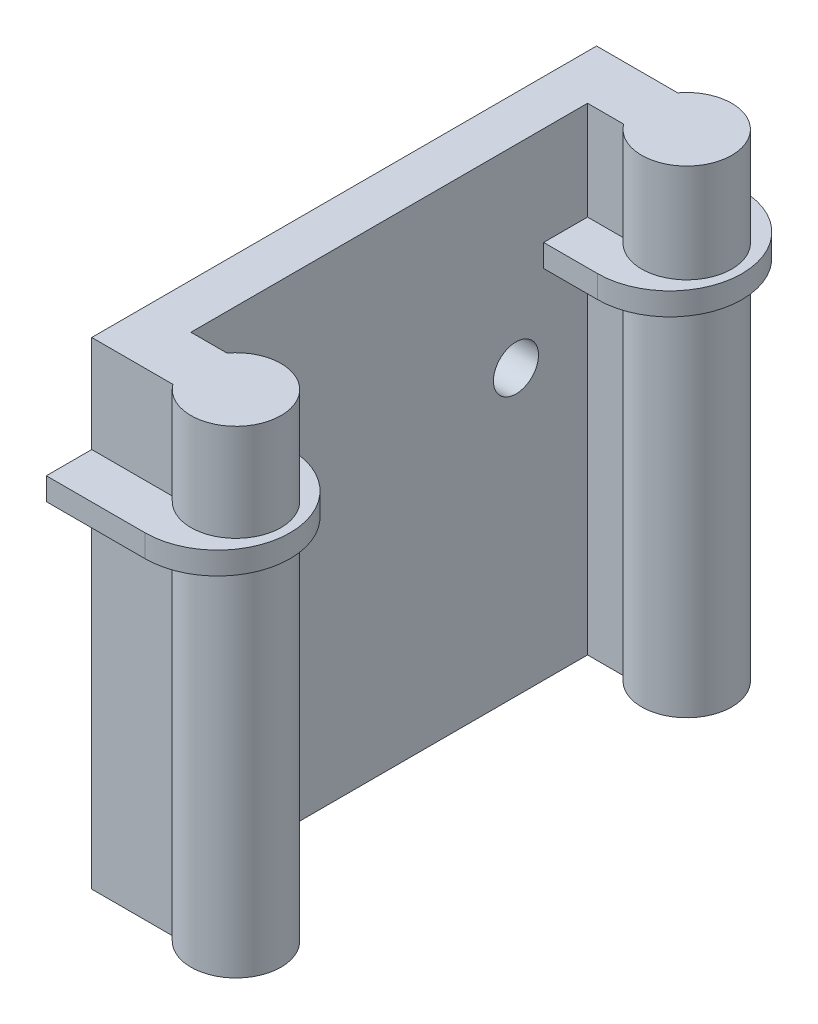
ISO-10303-21;
HEADER;
FILE_DESCRIPTION(('STEP AP214'),'2;1');
FILE_NAME('part.step','',(''),(''),'','','');
FILE_SCHEMA(('AUTOMOTIVE_DESIGN { 1 0 10303 214 1 1 1 1 }'));
ENDSEC;
DATA;
#1=APPLICATION_CONTEXT('core data for automotive mechanical design processes');
#2=APPLICATION_PROTOCOL_DEFINITION('international standard','automotive_design',2000,#1);
#3=PRODUCT_CONTEXT('',#1,'mechanical');
#4=PRODUCT('Part','Part','',(#3));
#5=PRODUCT_RELATED_PRODUCT_CATEGORY('part','',(#4));
#6=PRODUCT_DEFINITION_FORMATION('','',#4);
#7=PRODUCT_DEFINITION_CONTEXT('part definition',#1,'design');
#8=PRODUCT_DEFINITION('design','',#6,#7);
#9=PRODUCT_DEFINITION_SHAPE('','',#8);
#10=(LENGTH_UNIT() NAMED_UNIT(*) SI_UNIT(.MILLI.,.METRE.));
#11=(NAMED_UNIT(*) PLANE_ANGLE_UNIT() SI_UNIT($,.RADIAN.));
#12=(NAMED_UNIT(*) SI_UNIT($,.STERADIAN.) SOLID_ANGLE_UNIT());
#13=UNCERTAINTY_MEASURE_WITH_UNIT(LENGTH_MEASURE(1.E-05),#10,'distance_accuracy_value','');
#14=(GEOMETRIC_REPRESENTATION_CONTEXT(3) GLOBAL_UNCERTAINTY_ASSIGNED_CONTEXT((#13)) GLOBAL_UNIT_ASSIGNED_CONTEXT((#10,
#11,#12)) REPRESENTATION_CONTEXT('',''));
#15=CARTESIAN_POINT('',(0.,0.,0.));
#16=DIRECTION('',(0.,0.,1.));
#17=DIRECTION('',(1.,0.,0.));
#18=AXIS2_PLACEMENT_3D('',#15,#16,#17);
#19=CARTESIAN_POINT('',(10.9611068028665,-3.51530474199793,25.));
#20=DIRECTION('',(0.,-1.,0.));
#21=DIRECTION('',(0.,0.,-1.));
#22=AXIS2_PLACEMENT_3D('',#19,#20,#21);
#23=CYLINDRICAL_SURFACE('',#22,8.03889319713351);
#24=DIRECTION('',(0.,1.,0.));
#25=VECTOR('',#24,1.);
#26=CARTESIAN_POINT('',(10.9611068028665,-3.51530474199793,16.9611068028665));
#27=LINE('',#26,#25);
#28=CARTESIAN_POINT('',(10.9611068028665,-3.51530474199793,16.9611068028665));
#29=VERTEX_POINT('',#28);
#30=CARTESIAN_POINT('',(10.9611068028665,-6.0058250155197,16.9611068028665));
#31=VERTEX_POINT('',#30);
#32=EDGE_CURVE('E385',#29,#31,#27,.F.);
#33=ORIENTED_EDGE('',*,*,#32,.F.);
#34=CARTESIAN_POINT('',(10.9611068028665,-3.51530474199793,25.));
#35=DIRECTION('',(0.,1.,0.));
#36=DIRECTION('',(0.,0.,1.));
#37=AXIS2_PLACEMENT_3D('',#34,#35,#36);
#38=CIRCLE('',#37,8.03889319713351);
#39=CARTESIAN_POINT('',(10.9611068028665,-3.51530474199793,33.0388931971335));
#40=VERTEX_POINT('',#39);
#41=EDGE_CURVE('E43',#40,#29,#38,.T.);
#42=ORIENTED_EDGE('',*,*,#41,.F.);
#43=DIRECTION('',(0.,1.,0.));
#44=VECTOR('',#43,1.);
#45=CARTESIAN_POINT('',(10.9611068028665,-3.51530474199793,33.0388931971335));
#46=LINE('',#45,#44);
#47=CARTESIAN_POINT('',(10.9611068028665,-6.0058250155197,33.0388931971335));
#48=VERTEX_POINT('',#47);
#49=EDGE_CURVE('E388',#48,#40,#46,.T.);
#50=ORIENTED_EDGE('',*,*,#49,.F.);
#51=CARTESIAN_POINT('',(10.9611068028665,-6.0058250155197,25.));
#52=DIRECTION('',(0.,-1.,0.));
#53=DIRECTION('',(0.,0.,-1.));
#54=AXIS2_PLACEMENT_3D('',#51,#52,#53);
#55=CIRCLE('',#54,8.03889319713351);
#56=EDGE_CURVE('E11',#31,#48,#55,.T.);
#57=ORIENTED_EDGE('',*,*,#56,.F.);
#58=EDGE_LOOP('',(#33,#42,#50,#57));
#59=FACE_BOUND('',#58,.T.);
#60=ADVANCED_FACE('F35',(#59),#23,.T.);
#61=CARTESIAN_POINT('',(10.9951242614488,-3.6831613730081,-25.1306234986248));
#62=DIRECTION('',(0.,-1.,0.));
#63=DIRECTION('',(0.,0.,-1.));
#64=AXIS2_PLACEMENT_3D('',#61,#62,#63);
#65=CYLINDRICAL_SURFACE('',#64,8.00487573855121);
#66=DIRECTION('',(0.,-1.,0.));
#67=VECTOR('',#66,1.);
#68=CARTESIAN_POINT('',(10.9951242614488,-3.6831613730081,-33.1354992371761));
#69=LINE('',#68,#67);
#70=CARTESIAN_POINT('',(10.9951242614488,-3.6831613730081,-33.1354992371761));
#71=VERTEX_POINT('',#70);
#72=CARTESIAN_POINT('',(10.9951242614488,-6.1831613730081,-33.1354992371761));
#73=VERTEX_POINT('',#72);
#74=EDGE_CURVE('E201',#71,#73,#69,.T.);
#75=ORIENTED_EDGE('',*,*,#74,.F.);
#76=CARTESIAN_POINT('',(10.9951242614488,-3.6831613730081,-25.1306234986248));
#77=DIRECTION('',(0.,1.,0.));
#78=DIRECTION('',(0.,0.,1.));
#79=AXIS2_PLACEMENT_3D('',#76,#77,#78);
#80=CIRCLE('',#79,8.00487573855121);
#81=CARTESIAN_POINT('',(10.9951242614488,-3.6831613730081,-17.1257477600736));
#82=VERTEX_POINT('',#81);
#83=EDGE_CURVE('E381',#82,#71,#80,.T.);
#84=ORIENTED_EDGE('',*,*,#83,.F.);
#85=DIRECTION('',(0.,-1.,0.));
#86=VECTOR('',#85,1.);
#87=CARTESIAN_POINT('',(10.9951242614488,-3.6831613730081,-17.1257477600736));
#88=LINE('',#87,#86);
#89=CARTESIAN_POINT('',(10.9951242614488,-6.1831613730081,-17.1257477600736));
#90=VERTEX_POINT('',#89);
#91=EDGE_CURVE('E378',#90,#82,#88,.F.);
#92=ORIENTED_EDGE('',*,*,#91,.F.);
#93=CARTESIAN_POINT('',(10.9951242614488,-6.1831613730081,-25.1306234986248));
#94=DIRECTION('',(0.,-1.,0.));
#95=DIRECTION('',(0.,0.,-1.));
#96=AXIS2_PLACEMENT_3D('',#93,#94,#95);
#97=CIRCLE('',#96,8.00487573855121);
#98=EDGE_CURVE('E383',#73,#90,#97,.T.);
#99=ORIENTED_EDGE('',*,*,#98,.F.);
#100=EDGE_LOOP('',(#75,#84,#92,#99));
#101=FACE_BOUND('',#100,.T.);
#102=ADVANCED_FACE('F472',(#101),#65,.T.);
#103=CARTESIAN_POINT('',(5.,7.25022505990057,-28.));
#104=DIRECTION('',(0.,0.,1.));
#105=DIRECTION('',(0.,-1.,0.));
#106=AXIS2_PLACEMENT_3D('',#103,#104,#105);
#107=PLANE('',#106);
#108=DIRECTION('',(0.,1.,0.));
#109=VECTOR('',#108,1.);
#110=CARTESIAN_POINT('',(9.00000000000001,-45.7497749400995,-28.));
#111=LINE('',#110,#109);
#112=CARTESIAN_POINT('',(9.00000000000001,-3.6831613730081,-28.));
#113=VERTEX_POINT('',#112);
#114=CARTESIAN_POINT('',(9.00000000000001,7.25022505990057,-28.));
#115=VERTEX_POINT('',#114);
#116=EDGE_CURVE('E322',#113,#115,#111,.T.);
#117=ORIENTED_EDGE('',*,*,#116,.F.);
#118=DIRECTION('',(-1.,0.,0.));
#119=VECTOR('',#118,1.);
#120=CARTESIAN_POINT('',(5.,-3.6831613730081,-28.));
#121=LINE('',#120,#119);
#122=CARTESIAN_POINT('',(0.,-3.6831613730081,-28.));
#123=VERTEX_POINT('',#122);
#124=EDGE_CURVE('E233',#113,#123,#121,.T.);
#125=ORIENTED_EDGE('',*,*,#124,.T.);
#126=DIRECTION('',(0.,1.,0.));
#127=VECTOR('',#126,1.);
#128=CARTESIAN_POINT('',(0.,7.25022505990057,-28.));
#129=LINE('',#128,#127);
#130=CARTESIAN_POINT('',(0.,7.25022505990057,-28.));
#131=VERTEX_POINT('',#130);
#132=EDGE_CURVE('E330',#123,#131,#129,.T.);
#133=ORIENTED_EDGE('',*,*,#132,.T.);
#134=DIRECTION('',(-1.,0.,0.));
#135=VECTOR('',#134,1.);
#136=CARTESIAN_POINT('',(5.,7.25022505990057,-28.));
#137=LINE('',#136,#135);
#138=EDGE_CURVE('E358',#115,#131,#137,.T.);
#139=ORIENTED_EDGE('',*,*,#138,.F.);
#140=EDGE_LOOP('',(#117,#125,#133,#139));
#141=FACE_BOUND('',#140,.T.);
#142=ADVANCED_FACE('F453',(#141),#107,.F.);
#143=CARTESIAN_POINT('',(13.,-45.7497749400995,-25.));
#144=DIRECTION('',(0.,1.,0.));
#145=DIRECTION('',(0.,0.,1.));
#146=AXIS2_PLACEMENT_3D('',#143,#144,#145);
#147=CYLINDRICAL_SURFACE('',#146,5.);
#148=CARTESIAN_POINT('',(13.,-3.6831613730081,-25.));
#149=DIRECTION('',(0.,1.,0.));
#150=DIRECTION('',(0.,0.,1.));
#151=AXIS2_PLACEMENT_3D('',#148,#149,#150);
#152=CIRCLE('',#151,5.);
#153=CARTESIAN_POINT('',(9.00000000000001,-3.6831613730081,-22.));
#154=VERTEX_POINT('',#153);
#155=EDGE_CURVE('E231',#113,#154,#152,.F.);
#156=ORIENTED_EDGE('',*,*,#155,.F.);
#157=ORIENTED_EDGE('',*,*,#116,.T.);
#158=CARTESIAN_POINT('',(13.,7.25022505990057,-25.));
#159=DIRECTION('',(0.,1.,0.));
#160=DIRECTION('',(0.,0.,1.));
#161=AXIS2_PLACEMENT_3D('',#158,#159,#160);
#162=CIRCLE('',#161,5.);
#163=CARTESIAN_POINT('',(9.00000000000001,7.25022505990057,-22.));
#164=VERTEX_POINT('',#163);
#165=EDGE_CURVE('E314',#164,#115,#162,.T.);
#166=ORIENTED_EDGE('',*,*,#165,.F.);
#167=DIRECTION('',(0.,1.,0.));
#168=VECTOR('',#167,1.);
#169=CARTESIAN_POINT('',(9.00000000000001,-45.7497749400995,-22.));
#170=LINE('',#169,#168);
#171=EDGE_CURVE('E331',#154,#164,#170,.T.);
#172=ORIENTED_EDGE('',*,*,#171,.F.);
#173=EDGE_LOOP('',(#156,#157,#166,#172));
#174=FACE_BOUND('',#173,.T.);
#175=ADVANCED_FACE('F460',(#174),#147,.T.);
#176=CARTESIAN_POINT('',(0.,-45.7497749400995,-22.));
#177=DIRECTION('',(0.,0.,-1.));
#178=DIRECTION('',(-1.,0.,0.));
#179=AXIS2_PLACEMENT_3D('',#176,#177,#178);
#180=PLANE('',#179);
#181=DIRECTION('',(0.,1.,0.));
#182=VECTOR('',#181,1.);
#183=CARTESIAN_POINT('',(5.,0.,-22.));
#184=LINE('',#183,#182);
#185=CARTESIAN_POINT('',(5.,-3.6831613730081,-22.));
#186=VERTEX_POINT('',#185);
#187=CARTESIAN_POINT('',(5.,7.25022505990057,-22.));
#188=VERTEX_POINT('',#187);
#189=EDGE_CURVE('E361',#186,#188,#184,.T.);
#190=ORIENTED_EDGE('',*,*,#189,.F.);
#191=DIRECTION('',(1.,0.,0.));
#192=VECTOR('',#191,1.);
#193=CARTESIAN_POINT('',(0.,-3.6831613730081,-22.));
#194=LINE('',#193,#192);
#195=EDGE_CURVE('E374',#186,#154,#194,.T.);
#196=ORIENTED_EDGE('',*,*,#195,.T.);
#197=ORIENTED_EDGE('',*,*,#171,.T.);
#198=DIRECTION('',(-1.,0.,0.));
#199=VECTOR('',#198,1.);
#200=CARTESIAN_POINT('',(0.,7.25022505990057,-22.));
#201=LINE('',#200,#199);
#202=EDGE_CURVE('E319',#164,#188,#201,.T.);
#203=ORIENTED_EDGE('',*,*,#202,.T.);
#204=EDGE_LOOP('',(#190,#196,#197,#203));
#205=FACE_BOUND('',#204,.T.);
#206=ADVANCED_FACE('F465',(#205),#180,.F.);
#207=CARTESIAN_POINT('',(5.,7.25022505990057,28.));
#208=DIRECTION('',(0.,0.,-1.));
#209=DIRECTION('',(0.,1.,0.));
#210=AXIS2_PLACEMENT_3D('',#207,#208,#209);
#211=PLANE('',#210);
#212=DIRECTION('',(0.,1.,0.));
#213=VECTOR('',#212,1.);
#214=CARTESIAN_POINT('',(9.00000000000001,-45.7497749400995,28.));
#215=LINE('',#214,#213);
#216=CARTESIAN_POINT('',(9.00000000000001,-45.7497749400995,28.));
#217=VERTEX_POINT('',#216);
#218=CARTESIAN_POINT('',(9.00000000000001,-6.0058250155197,28.));
#219=VERTEX_POINT('',#218);
#220=EDGE_CURVE('E303',#217,#219,#215,.T.);
#221=ORIENTED_EDGE('',*,*,#220,.T.);
#222=DIRECTION('',(-1.,0.,0.));
#223=VECTOR('',#222,1.);
#224=CARTESIAN_POINT('',(5.,-6.0058250155197,28.));
#225=LINE('',#224,#223);
#226=CARTESIAN_POINT('',(0.,-6.0058250155197,28.));
#227=VERTEX_POINT('',#226);
#228=EDGE_CURVE('E270',#219,#227,#225,.T.);
#229=ORIENTED_EDGE('',*,*,#228,.T.);
#230=DIRECTION('',(0.,-1.,0.));
#231=VECTOR('',#230,1.);
#232=CARTESIAN_POINT('',(0.,7.25022505990057,28.));
#233=LINE('',#232,#231);
#234=CARTESIAN_POINT('',(0.,-45.7497749400994,28.));
#235=VERTEX_POINT('',#234);
#236=EDGE_CURVE('E347',#227,#235,#233,.T.);
#237=ORIENTED_EDGE('',*,*,#236,.T.);
#238=DIRECTION('',(-1.,0.,0.));
#239=VECTOR('',#238,1.);
#240=CARTESIAN_POINT('',(5.,-45.7497749400994,28.));
#241=LINE('',#240,#239);
#242=EDGE_CURVE('E353',#217,#235,#241,.T.);
#243=ORIENTED_EDGE('',*,*,#242,.F.);
#244=EDGE_LOOP('',(#221,#229,#237,#243));
#245=FACE_BOUND('',#244,.T.);
#246=ADVANCED_FACE('F488',(#245),#211,.F.);
#247=CARTESIAN_POINT('',(13.,-45.7497749400995,25.));
#248=DIRECTION('',(0.,1.,0.));
#249=DIRECTION('',(0.,0.,1.));
#250=AXIS2_PLACEMENT_3D('',#247,#248,#249);
#251=CYLINDRICAL_SURFACE('',#250,5.);
#252=CARTESIAN_POINT('',(13.,-6.0058250155197,25.));
#253=DIRECTION('',(0.,-1.,0.));
#254=DIRECTION('',(0.,0.,-1.));
#255=AXIS2_PLACEMENT_3D('',#252,#253,#254);
#256=CIRCLE('',#255,5.);
#257=CARTESIAN_POINT('',(9.00000000000001,-6.0058250155197,22.));
#258=VERTEX_POINT('',#257);
#259=EDGE_CURVE('E267',#219,#258,#256,.F.);
#260=ORIENTED_EDGE('',*,*,#259,.F.);
#261=ORIENTED_EDGE('',*,*,#220,.F.);
#262=CARTESIAN_POINT('',(13.,-45.7497749400995,25.));
#263=DIRECTION('',(0.,1.,0.));
#264=DIRECTION('',(0.,0.,1.));
#265=AXIS2_PLACEMENT_3D('',#262,#263,#264);
#266=CIRCLE('',#265,5.);
#267=CARTESIAN_POINT('',(9.00000000000001,-45.7497749400995,22.));
#268=VERTEX_POINT('',#267);
#269=EDGE_CURVE('E291',#217,#268,#266,.T.);
#270=ORIENTED_EDGE('',*,*,#269,.T.);
#271=DIRECTION('',(0.,1.,0.));
#272=VECTOR('',#271,1.);
#273=CARTESIAN_POINT('',(9.00000000000001,-45.7497749400995,22.));
#274=LINE('',#273,#272);
#275=EDGE_CURVE('E308',#268,#258,#274,.T.);
#276=ORIENTED_EDGE('',*,*,#275,.T.);
#277=EDGE_LOOP('',(#260,#261,#270,#276));
#278=FACE_BOUND('',#277,.T.);
#279=ADVANCED_FACE('F409',(#278),#251,.T.);
#280=CARTESIAN_POINT('',(0.,-45.7497749400995,22.));
#281=DIRECTION('',(0.,0.,-1.));
#282=DIRECTION('',(-1.,0.,0.));
#283=AXIS2_PLACEMENT_3D('',#280,#281,#282);
#284=PLANE('',#283);
#285=DIRECTION('',(-1.,0.,0.));
#286=VECTOR('',#285,1.);
#287=CARTESIAN_POINT('',(0.,-6.0058250155197,22.));
#288=LINE('',#287,#286);
#289=CARTESIAN_POINT('',(5.,-6.0058250155197,22.));
#290=VERTEX_POINT('',#289);
#291=EDGE_CURVE('E368',#258,#290,#288,.T.);
#292=ORIENTED_EDGE('',*,*,#291,.F.);
#293=ORIENTED_EDGE('',*,*,#275,.F.);
#294=DIRECTION('',(-1.,0.,0.));
#295=VECTOR('',#294,1.);
#296=CARTESIAN_POINT('',(0.,-45.7497749400995,22.));
#297=LINE('',#296,#295);
#298=CARTESIAN_POINT('',(5.,-45.7497749400994,22.));
#299=VERTEX_POINT('',#298);
#300=EDGE_CURVE('E294',#268,#299,#297,.T.);
#301=ORIENTED_EDGE('',*,*,#300,.T.);
#302=DIRECTION('',(0.,1.,0.));
#303=VECTOR('',#302,1.);
#304=CARTESIAN_POINT('',(5.,0.,22.));
#305=LINE('',#304,#303);
#306=EDGE_CURVE('E311',#299,#290,#305,.T.);
#307=ORIENTED_EDGE('',*,*,#306,.T.);
#308=EDGE_LOOP('',(#292,#293,#301,#307));
#309=FACE_BOUND('',#308,.T.);
#310=ADVANCED_FACE('F406',(#309),#284,.T.);
#311=CARTESIAN_POINT('',(5.,0.,0.));
#312=DIRECTION('',(1.,0.,0.));
#313=DIRECTION('',(0.,0.,-1.));
#314=AXIS2_PLACEMENT_3D('',#311,#312,#313);
#315=PLANE('',#314);
#316=DIRECTION('',(0.,0.,1.));
#317=VECTOR('',#316,1.);
#318=CARTESIAN_POINT('',(5.,-3.6831613730081,0.));
#319=LINE('',#318,#317);
#320=CARTESIAN_POINT('',(5.,-3.6831613730081,-17.1257477600736));
#321=VERTEX_POINT('',#320);
#322=EDGE_CURVE('E236',#186,#321,#319,.T.);
#323=ORIENTED_EDGE('',*,*,#322,.F.);
#324=ORIENTED_EDGE('',*,*,#189,.T.);
#325=DIRECTION('',(0.,0.,1.));
#326=VECTOR('',#325,1.);
#327=CARTESIAN_POINT('',(5.,7.25022505990057,28.));
#328=LINE('',#327,#326);
#329=CARTESIAN_POINT('',(5.,7.25022505990057,22.));
#330=VERTEX_POINT('',#329);
#331=EDGE_CURVE('E335',#188,#330,#328,.T.);
#332=ORIENTED_EDGE('',*,*,#331,.T.);
#333=CARTESIAN_POINT('',(5.,-3.51530474199793,22.));
#334=VERTEX_POINT('',#333);
#335=EDGE_CURVE('E306',#334,#330,#305,.T.);
#336=ORIENTED_EDGE('',*,*,#335,.F.);
#337=DIRECTION('',(0.,0.,1.));
#338=VECTOR('',#337,1.);
#339=CARTESIAN_POINT('',(5.,-3.51530474199793,0.));
#340=LINE('',#339,#338);
#341=CARTESIAN_POINT('',(5.,-3.51530474199793,16.9611068028665));
#342=VERTEX_POINT('',#341);
#343=EDGE_CURVE('E264',#342,#334,#340,.T.);
#344=ORIENTED_EDGE('',*,*,#343,.F.);
#345=DIRECTION('',(0.,1.,0.));
#346=VECTOR('',#345,1.);
#347=CARTESIAN_POINT('',(5.,0.,16.9611068028665));
#348=LINE('',#347,#346);
#349=CARTESIAN_POINT('',(5.,-6.0058250155197,16.9611068028665));
#350=VERTEX_POINT('',#349);
#351=EDGE_CURVE('E275',#350,#342,#348,.T.);
#352=ORIENTED_EDGE('',*,*,#351,.F.);
#353=DIRECTION('',(0.,0.,-1.));
#354=VECTOR('',#353,1.);
#355=CARTESIAN_POINT('',(5.,-6.0058250155197,0.));
#356=LINE('',#355,#354);
#357=EDGE_CURVE('E272',#290,#350,#356,.T.);
#358=ORIENTED_EDGE('',*,*,#357,.F.);
#359=ORIENTED_EDGE('',*,*,#306,.F.);
#360=DIRECTION('',(0.,0.,-1.));
#361=VECTOR('',#360,1.);
#362=CARTESIAN_POINT('',(5.,-45.7497749400994,28.));
#363=LINE('',#362,#361);
#364=CARTESIAN_POINT('',(5.,-45.7497749400994,-22.));
#365=VERTEX_POINT('',#364);
#366=EDGE_CURVE('E338',#299,#365,#363,.T.);
#367=ORIENTED_EDGE('',*,*,#366,.T.);
#368=CARTESIAN_POINT('',(5.,-6.1831613730081,-22.));
#369=VERTEX_POINT('',#368);
#370=EDGE_CURVE('E362',#365,#369,#184,.T.);
#371=ORIENTED_EDGE('',*,*,#370,.T.);
#372=DIRECTION('',(0.,0.,-1.));
#373=VECTOR('',#372,1.);
#374=CARTESIAN_POINT('',(5.,-6.1831613730081,0.));
#375=LINE('',#374,#373);
#376=CARTESIAN_POINT('',(5.,-6.1831613730081,-17.1257477600736));
#377=VERTEX_POINT('',#376);
#378=EDGE_CURVE('E229',#377,#369,#375,.T.);
#379=ORIENTED_EDGE('',*,*,#378,.F.);
#380=DIRECTION('',(0.,-1.,0.));
#381=VECTOR('',#380,1.);
#382=CARTESIAN_POINT('',(5.,0.,-17.1257477600736));
#383=LINE('',#382,#381);
#384=EDGE_CURVE('E239',#321,#377,#383,.T.);
#385=ORIENTED_EDGE('',*,*,#384,.F.);
#386=EDGE_LOOP('',(#323,#324,#332,#336,#344,#352,#358,#359,#367,#371,#379,#385));
#387=FACE_BOUND('',#386,.T.);
#388=CARTESIAN_POINT('',(5.00000000000003,-14.205462455258,-14.06));
#389=DIRECTION('',(-1.,0.,0.));
#390=DIRECTION('',(0.,0.,1.));
#391=AXIS2_PLACEMENT_3D('',#388,#389,#390);
#392=CIRCLE('',#391,2.5);
#393=CARTESIAN_POINT('',(5.00000000000003,-14.205462455258,-11.56));
#394=VERTEX_POINT('',#393);
#395=EDGE_CURVE('E279',#394,#394,#392,.T.);
#396=ORIENTED_EDGE('',*,*,#395,.T.);
#397=EDGE_LOOP('',(#396));
#398=FACE_BOUND('',#397,.T.);
#399=CARTESIAN_POINT('',(5.00000000000003,-14.205462455258,14.0577984565381));
#400=DIRECTION('',(-1.,0.,0.));
#401=DIRECTION('',(0.,0.,1.));
#402=AXIS2_PLACEMENT_3D('',#399,#400,#401);
#403=CIRCLE('',#402,2.5);
#404=CARTESIAN_POINT('',(5.00000000000003,-14.205462455258,16.5577984565381));
#405=VERTEX_POINT('',#404);
#406=EDGE_CURVE('E285',#405,#405,#403,.T.);
#407=ORIENTED_EDGE('',*,*,#406,.T.);
#408=EDGE_LOOP('',(#407));
#409=FACE_BOUND('',#408,.T.);
#410=ADVANCED_FACE('F400',(#387,#398,#409),#315,.T.);
#411=CARTESIAN_POINT('',(0.,-45.7497749400994,-28.));
#412=VERTEX_POINT('',#411);
#413=CARTESIAN_POINT('',(0.,-6.1831613730081,-28.));
#414=VERTEX_POINT('',#413);
#415=EDGE_CURVE('E342',#412,#414,#129,.T.);
#416=ORIENTED_EDGE('',*,*,#415,.T.);
#417=DIRECTION('',(1.,0.,0.));
#418=VECTOR('',#417,1.);
#419=CARTESIAN_POINT('',(5.,-6.1831613730081,-28.));
#420=LINE('',#419,#418);
#421=CARTESIAN_POINT('',(9.00000000000001,-6.1831613730081,-28.));
#422=VERTEX_POINT('',#421);
#423=EDGE_CURVE('E210',#414,#422,#420,.T.);
#424=ORIENTED_EDGE('',*,*,#423,.T.);
#425=CARTESIAN_POINT('',(9.00000000000001,-45.7497749400995,-28.));
#426=VERTEX_POINT('',#425);
#427=EDGE_CURVE('E332',#426,#422,#111,.T.);
#428=ORIENTED_EDGE('',*,*,#427,.F.);
#429=DIRECTION('',(-1.,0.,0.));
#430=VECTOR('',#429,1.);
#431=CARTESIAN_POINT('',(5.,-45.7497749400994,-28.));
#432=LINE('',#431,#430);
#433=EDGE_CURVE('E341',#426,#412,#432,.T.);
#434=ORIENTED_EDGE('',*,*,#433,.T.);
#435=EDGE_LOOP('',(#416,#424,#428,#434));
#436=FACE_BOUND('',#435,.T.);
#437=ADVANCED_FACE('F427',(#436),#107,.F.);
#438=CARTESIAN_POINT('',(5.,7.25022505990057,28.));
#439=DIRECTION('',(0.,-1.,0.));
#440=DIRECTION('',(0.,0.,-1.));
#441=AXIS2_PLACEMENT_3D('',#438,#439,#440);
#442=PLANE('',#441);
#443=DIRECTION('',(0.,0.,1.));
#444=VECTOR('',#443,1.);
#445=CARTESIAN_POINT('',(0.,7.25022505990057,28.));
#446=LINE('',#445,#444);
#447=CARTESIAN_POINT('',(0.,7.25022505990057,28.));
#448=VERTEX_POINT('',#447);
#449=EDGE_CURVE('E344',#131,#448,#446,.T.);
#450=ORIENTED_EDGE('',*,*,#449,.T.);
#451=DIRECTION('',(-1.,0.,0.));
#452=VECTOR('',#451,1.);
#453=CARTESIAN_POINT('',(5.,7.25022505990057,28.));
#454=LINE('',#453,#452);
#455=CARTESIAN_POINT('',(9.00000000000001,7.25022505990057,28.));
#456=VERTEX_POINT('',#455);
#457=EDGE_CURVE('E356',#456,#448,#454,.T.);
#458=ORIENTED_EDGE('',*,*,#457,.F.);
#459=CARTESIAN_POINT('',(13.,7.25022505990057,25.));
#460=DIRECTION('',(0.,1.,0.));
#461=DIRECTION('',(0.,0.,1.));
#462=AXIS2_PLACEMENT_3D('',#459,#460,#461);
#463=CIRCLE('',#462,5.);
#464=CARTESIAN_POINT('',(9.00000000000001,7.25022505990057,22.));
#465=VERTEX_POINT('',#464);
#466=EDGE_CURVE('E288',#456,#465,#463,.T.);
#467=ORIENTED_EDGE('',*,*,#466,.T.);
#468=DIRECTION('',(-1.,0.,0.));
#469=VECTOR('',#468,1.);
#470=CARTESIAN_POINT('',(0.,7.25022505990057,22.));
#471=LINE('',#470,#469);
#472=EDGE_CURVE('E295',#465,#330,#471,.T.);
#473=ORIENTED_EDGE('',*,*,#472,.T.);
#474=ORIENTED_EDGE('',*,*,#331,.F.);
#475=ORIENTED_EDGE('',*,*,#202,.F.);
#476=ORIENTED_EDGE('',*,*,#165,.T.);
#477=ORIENTED_EDGE('',*,*,#138,.T.);
#478=EDGE_LOOP('',(#450,#458,#467,#473,#474,#475,#476,#477));
#479=FACE_BOUND('',#478,.T.);
#480=ADVANCED_FACE('F448',(#479),#442,.F.);
#481=CARTESIAN_POINT('',(0.,-3.51530474199793,28.));
#482=VERTEX_POINT('',#481);
#483=EDGE_CURVE('E348',#448,#482,#233,.T.);
#484=ORIENTED_EDGE('',*,*,#483,.T.);
#485=DIRECTION('',(1.,0.,0.));
#486=VECTOR('',#485,1.);
#487=CARTESIAN_POINT('',(5.,-3.51530474199793,28.));
#488=LINE('',#487,#486);
#489=CARTESIAN_POINT('',(9.00000000000001,-3.51530474199793,28.));
#490=VERTEX_POINT('',#489);
#491=EDGE_CURVE('E262',#482,#490,#488,.T.);
#492=ORIENTED_EDGE('',*,*,#491,.T.);
#493=EDGE_CURVE('E307',#490,#456,#215,.T.);
#494=ORIENTED_EDGE('',*,*,#493,.T.);
#495=ORIENTED_EDGE('',*,*,#457,.T.);
#496=EDGE_LOOP('',(#484,#492,#494,#495));
#497=FACE_BOUND('',#496,.T.);
#498=ADVANCED_FACE('F441',(#497),#211,.F.);
#499=CARTESIAN_POINT('',(5.,-45.7497749400994,28.));
#500=DIRECTION('',(0.,1.,0.));
#501=DIRECTION('',(0.,0.,1.));
#502=AXIS2_PLACEMENT_3D('',#499,#500,#501);
#503=PLANE('',#502);
#504=ORIENTED_EDGE('',*,*,#242,.T.);
#505=DIRECTION('',(0.,0.,-1.));
#506=VECTOR('',#505,1.);
#507=CARTESIAN_POINT('',(0.,-45.7497749400994,28.));
#508=LINE('',#507,#506);
#509=EDGE_CURVE('E339',#235,#412,#508,.T.);
#510=ORIENTED_EDGE('',*,*,#509,.T.);
#511=ORIENTED_EDGE('',*,*,#433,.F.);
#512=CARTESIAN_POINT('',(13.,-45.7497749400995,-25.));
#513=DIRECTION('',(0.,1.,0.));
#514=DIRECTION('',(0.,0.,1.));
#515=AXIS2_PLACEMENT_3D('',#512,#513,#514);
#516=CIRCLE('',#515,5.);
#517=CARTESIAN_POINT('',(9.00000000000001,-45.7497749400995,-22.));
#518=VERTEX_POINT('',#517);
#519=EDGE_CURVE('E315',#518,#426,#516,.T.);
#520=ORIENTED_EDGE('',*,*,#519,.F.);
#521=DIRECTION('',(-1.,0.,0.));
#522=VECTOR('',#521,1.);
#523=CARTESIAN_POINT('',(0.,-45.7497749400995,-22.));
#524=LINE('',#523,#522);
#525=EDGE_CURVE('E318',#518,#365,#524,.T.);
#526=ORIENTED_EDGE('',*,*,#525,.T.);
#527=ORIENTED_EDGE('',*,*,#366,.F.);
#528=ORIENTED_EDGE('',*,*,#300,.F.);
#529=ORIENTED_EDGE('',*,*,#269,.F.);
#530=EDGE_LOOP('',(#504,#510,#511,#520,#526,#527,#528,#529));
#531=FACE_BOUND('',#530,.T.);
#532=ADVANCED_FACE('F413',(#531),#503,.F.);
#533=CARTESIAN_POINT('',(0.,0.,0.));
#534=DIRECTION('',(1.,0.,0.));
#535=DIRECTION('',(0.,0.,-1.));
#536=AXIS2_PLACEMENT_3D('',#533,#534,#535);
#537=PLANE('',#536);
#538=CARTESIAN_POINT('',(0.,-14.205462455258,-14.06));
#539=DIRECTION('',(-1.,0.,0.));
#540=DIRECTION('',(0.,0.,1.));
#541=AXIS2_PLACEMENT_3D('',#538,#539,#540);
#542=CIRCLE('',#541,2.5);
#543=CARTESIAN_POINT('',(0.,-14.205462455258,-11.56));
#544=VERTEX_POINT('',#543);
#545=EDGE_CURVE('E278',#544,#544,#542,.T.);
#546=ORIENTED_EDGE('',*,*,#545,.F.);
#547=EDGE_LOOP('',(#546));
#548=FACE_BOUND('',#547,.T.);
#549=CARTESIAN_POINT('',(0.,-14.205462455258,14.0577984565381));
#550=DIRECTION('',(-1.,0.,0.));
#551=DIRECTION('',(0.,0.,1.));
#552=AXIS2_PLACEMENT_3D('',#549,#550,#551);
#553=CIRCLE('',#552,2.5);
#554=CARTESIAN_POINT('',(0.,-14.205462455258,16.5577984565381));
#555=VERTEX_POINT('',#554);
#556=EDGE_CURVE('E282',#555,#555,#553,.T.);
#557=ORIENTED_EDGE('',*,*,#556,.F.);
#558=EDGE_LOOP('',(#557));
#559=FACE_BOUND('',#558,.T.);
#560=ORIENTED_EDGE('',*,*,#132,.F.);
#561=DIRECTION('',(0.,0.,-1.));
#562=VECTOR('',#561,1.);
#563=CARTESIAN_POINT('',(0.,-3.6831613730081,-17.1257477600736));
#564=LINE('',#563,#562);
#565=CARTESIAN_POINT('',(0.,-3.6831613730081,-33.1354992371761));
#566=VERTEX_POINT('',#565);
#567=EDGE_CURVE('E204',#123,#566,#564,.T.);
#568=ORIENTED_EDGE('',*,*,#567,.T.);
#569=DIRECTION('',(0.,-1.,0.));
#570=VECTOR('',#569,1.);
#571=CARTESIAN_POINT('',(0.,-3.6831613730081,-33.1354992371761));
#572=LINE('',#571,#570);
#573=CARTESIAN_POINT('',(0.,-6.1831613730081,-33.1354992371761));
#574=VERTEX_POINT('',#573);
#575=EDGE_CURVE('E199',#566,#574,#572,.T.);
#576=ORIENTED_EDGE('',*,*,#575,.T.);
#577=DIRECTION('',(0.,0.,1.));
#578=VECTOR('',#577,1.);
#579=CARTESIAN_POINT('',(0.,-6.1831613730081,-17.1257477600736));
#580=LINE('',#579,#578);
#581=EDGE_CURVE('E207',#574,#414,#580,.T.);
#582=ORIENTED_EDGE('',*,*,#581,.T.);
#583=ORIENTED_EDGE('',*,*,#415,.F.);
#584=ORIENTED_EDGE('',*,*,#509,.F.);
#585=ORIENTED_EDGE('',*,*,#236,.F.);
#586=DIRECTION('',(0.,0.,1.));
#587=VECTOR('',#586,1.);
#588=CARTESIAN_POINT('',(0.,-6.0058250155197,16.9611068028665));
#589=LINE('',#588,#587);
#590=CARTESIAN_POINT('',(0.,-6.0058250155197,33.0388931971335));
#591=VERTEX_POINT('',#590);
#592=EDGE_CURVE('E248',#227,#591,#589,.T.);
#593=ORIENTED_EDGE('',*,*,#592,.T.);
#594=DIRECTION('',(0.,1.,0.));
#595=VECTOR('',#594,1.);
#596=CARTESIAN_POINT('',(0.,-3.51530474199793,33.0388931971335));
#597=LINE('',#596,#595);
#598=CARTESIAN_POINT('',(0.,-3.51530474199793,33.0388931971335));
#599=VERTEX_POINT('',#598);
#600=EDGE_CURVE('E242',#591,#599,#597,.T.);
#601=ORIENTED_EDGE('',*,*,#600,.T.);
#602=DIRECTION('',(0.,0.,-1.));
#603=VECTOR('',#602,1.);
#604=CARTESIAN_POINT('',(0.,-3.51530474199793,16.9611068028665));
#605=LINE('',#604,#603);
#606=EDGE_CURVE('E245',#599,#482,#605,.T.);
#607=ORIENTED_EDGE('',*,*,#606,.T.);
#608=ORIENTED_EDGE('',*,*,#483,.F.);
#609=ORIENTED_EDGE('',*,*,#449,.F.);
#610=EDGE_LOOP('',(#560,#568,#576,#582,#583,#584,#585,#593,#601,#607,#608,#609));
#611=FACE_BOUND('',#610,.T.);
#612=ADVANCED_FACE('F217',(#548,#559,#611),#537,.F.);
#613=CARTESIAN_POINT('',(13.,-6.1831613730081,-25.));
#614=DIRECTION('',(0.,-1.,0.));
#615=DIRECTION('',(0.,0.,-1.));
#616=AXIS2_PLACEMENT_3D('',#613,#614,#615);
#617=CIRCLE('',#616,5.);
#618=CARTESIAN_POINT('',(9.00000000000001,-6.1831613730081,-22.));
#619=VERTEX_POINT('',#618);
#620=EDGE_CURVE('E223',#619,#422,#617,.F.);
#621=ORIENTED_EDGE('',*,*,#620,.F.);
#622=EDGE_CURVE('E327',#518,#619,#170,.T.);
#623=ORIENTED_EDGE('',*,*,#622,.F.);
#624=ORIENTED_EDGE('',*,*,#519,.T.);
#625=ORIENTED_EDGE('',*,*,#427,.T.);
#626=EDGE_LOOP('',(#621,#623,#624,#625));
#627=FACE_BOUND('',#626,.T.);
#628=ADVANCED_FACE('F424',(#627),#147,.T.);
#629=ORIENTED_EDGE('',*,*,#622,.T.);
#630=DIRECTION('',(-1.,0.,0.));
#631=VECTOR('',#630,1.);
#632=CARTESIAN_POINT('',(0.,-6.1831613730081,-22.));
#633=LINE('',#632,#631);
#634=EDGE_CURVE('E371',#619,#369,#633,.T.);
#635=ORIENTED_EDGE('',*,*,#634,.T.);
#636=ORIENTED_EDGE('',*,*,#370,.F.);
#637=ORIENTED_EDGE('',*,*,#525,.F.);
#638=EDGE_LOOP('',(#629,#635,#636,#637));
#639=FACE_BOUND('',#638,.T.);
#640=ADVANCED_FACE('F421',(#639),#180,.F.);
#641=CARTESIAN_POINT('',(13.,-3.51530474199793,25.));
#642=DIRECTION('',(0.,1.,0.));
#643=DIRECTION('',(0.,0.,1.));
#644=AXIS2_PLACEMENT_3D('',#641,#642,#643);
#645=CIRCLE('',#644,5.);
#646=CARTESIAN_POINT('',(9.00000000000001,-3.51530474199793,22.));
#647=VERTEX_POINT('',#646);
#648=EDGE_CURVE('E254',#647,#490,#645,.F.);
#649=ORIENTED_EDGE('',*,*,#648,.F.);
#650=EDGE_CURVE('E298',#647,#465,#274,.T.);
#651=ORIENTED_EDGE('',*,*,#650,.T.);
#652=ORIENTED_EDGE('',*,*,#466,.F.);
#653=ORIENTED_EDGE('',*,*,#493,.F.);
#654=EDGE_LOOP('',(#649,#651,#652,#653));
#655=FACE_BOUND('',#654,.T.);
#656=ADVANCED_FACE('F445',(#655),#251,.T.);
#657=DIRECTION('',(1.,0.,0.));
#658=VECTOR('',#657,1.);
#659=CARTESIAN_POINT('',(0.,-3.51530474199793,22.));
#660=LINE('',#659,#658);
#661=EDGE_CURVE('E365',#334,#647,#660,.T.);
#662=ORIENTED_EDGE('',*,*,#661,.F.);
#663=ORIENTED_EDGE('',*,*,#335,.T.);
#664=ORIENTED_EDGE('',*,*,#472,.F.);
#665=ORIENTED_EDGE('',*,*,#650,.F.);
#666=EDGE_LOOP('',(#662,#663,#664,#665));
#667=FACE_BOUND('',#666,.T.);
#668=ADVANCED_FACE('F502',(#667),#284,.T.);
#669=CARTESIAN_POINT('',(5.00000000000003,-14.205462455258,14.0577984565381));
#670=DIRECTION('',(-1.,0.,0.));
#671=DIRECTION('',(0.,0.,1.));
#672=AXIS2_PLACEMENT_3D('',#669,#670,#671);
#673=CYLINDRICAL_SURFACE('',#672,2.5);
#674=ORIENTED_EDGE('',*,*,#406,.F.);
#675=EDGE_LOOP('',(#674));
#676=FACE_BOUND('',#675,.T.);
#677=ORIENTED_EDGE('',*,*,#556,.T.);
#678=EDGE_LOOP('',(#677));
#679=FACE_BOUND('',#678,.T.);
#680=ADVANCED_FACE('F505',(#676,#679),#673,.F.);
#681=CARTESIAN_POINT('',(5.00000000000003,-14.205462455258,-14.06));
#682=DIRECTION('',(-1.,0.,0.));
#683=DIRECTION('',(0.,0.,1.));
#684=AXIS2_PLACEMENT_3D('',#681,#682,#683);
#685=CYLINDRICAL_SURFACE('',#684,2.5);
#686=ORIENTED_EDGE('',*,*,#395,.F.);
#687=EDGE_LOOP('',(#686));
#688=FACE_BOUND('',#687,.T.);
#689=ORIENTED_EDGE('',*,*,#545,.T.);
#690=EDGE_LOOP('',(#689));
#691=FACE_BOUND('',#690,.T.);
#692=ADVANCED_FACE('F509',(#688,#691),#685,.F.);
#693=CARTESIAN_POINT('',(19.,-3.51530474199793,33.0388931971335));
#694=DIRECTION('',(0.,0.,1.));
#695=DIRECTION('',(1.,0.,0.));
#696=AXIS2_PLACEMENT_3D('',#693,#694,#695);
#697=PLANE('',#696);
#698=DIRECTION('',(-1.,0.,0.));
#699=VECTOR('',#698,1.);
#700=CARTESIAN_POINT('',(19.,-6.0058250155197,33.0388931971335));
#701=LINE('',#700,#699);
#702=EDGE_CURVE('E252',#48,#591,#701,.T.);
#703=ORIENTED_EDGE('',*,*,#702,.F.);
#704=ORIENTED_EDGE('',*,*,#49,.T.);
#705=DIRECTION('',(-1.,0.,0.));
#706=VECTOR('',#705,1.);
#707=CARTESIAN_POINT('',(19.,-3.51530474199793,33.0388931971335));
#708=LINE('',#707,#706);
#709=EDGE_CURVE('E251',#40,#599,#708,.T.);
#710=ORIENTED_EDGE('',*,*,#709,.T.);
#711=ORIENTED_EDGE('',*,*,#600,.F.);
#712=EDGE_LOOP('',(#703,#704,#710,#711));
#713=FACE_BOUND('',#712,.T.);
#714=ADVANCED_FACE('F434',(#713),#697,.T.);
#715=CARTESIAN_POINT('',(19.,-6.0058250155197,16.9611068028665));
#716=DIRECTION('',(0.,-1.,0.));
#717=DIRECTION('',(0.,0.,-1.));
#718=AXIS2_PLACEMENT_3D('',#715,#716,#717);
#719=PLANE('',#718);
#720=DIRECTION('',(-1.,0.,0.));
#721=VECTOR('',#720,1.);
#722=CARTESIAN_POINT('',(19.,-6.0058250155197,16.9611068028665));
#723=LINE('',#722,#721);
#724=EDGE_CURVE('E255',#31,#350,#723,.T.);
#725=ORIENTED_EDGE('',*,*,#724,.F.);
#726=ORIENTED_EDGE('',*,*,#56,.T.);
#727=ORIENTED_EDGE('',*,*,#702,.T.);
#728=ORIENTED_EDGE('',*,*,#592,.F.);
#729=ORIENTED_EDGE('',*,*,#228,.F.);
#730=ORIENTED_EDGE('',*,*,#259,.T.);
#731=ORIENTED_EDGE('',*,*,#291,.T.);
#732=ORIENTED_EDGE('',*,*,#357,.T.);
#733=EDGE_LOOP('',(#725,#726,#727,#728,#729,#730,#731,#732));
#734=FACE_BOUND('',#733,.T.);
#735=ADVANCED_FACE('F403',(#734),#719,.T.);
#736=CARTESIAN_POINT('',(19.,-3.51530474199793,16.9611068028665));
#737=DIRECTION('',(0.,0.,-1.));
#738=DIRECTION('',(-1.,0.,0.));
#739=AXIS2_PLACEMENT_3D('',#736,#737,#738);
#740=PLANE('',#739);
#741=DIRECTION('',(-1.,0.,0.));
#742=VECTOR('',#741,1.);
#743=CARTESIAN_POINT('',(19.,-3.51530474199793,16.9611068028665));
#744=LINE('',#743,#742);
#745=EDGE_CURVE('E257',#29,#342,#744,.T.);
#746=ORIENTED_EDGE('',*,*,#745,.F.);
#747=ORIENTED_EDGE('',*,*,#32,.T.);
#748=ORIENTED_EDGE('',*,*,#724,.T.);
#749=ORIENTED_EDGE('',*,*,#351,.T.);
#750=EDGE_LOOP('',(#746,#747,#748,#749));
#751=FACE_BOUND('',#750,.T.);
#752=ADVANCED_FACE('F396',(#751),#740,.T.);
#753=CARTESIAN_POINT('',(19.,-3.51530474199793,16.9611068028665));
#754=DIRECTION('',(0.,1.,0.));
#755=DIRECTION('',(0.,0.,1.));
#756=AXIS2_PLACEMENT_3D('',#753,#754,#755);
#757=PLANE('',#756);
#758=ORIENTED_EDGE('',*,*,#709,.F.);
#759=ORIENTED_EDGE('',*,*,#41,.T.);
#760=ORIENTED_EDGE('',*,*,#745,.T.);
#761=ORIENTED_EDGE('',*,*,#343,.T.);
#762=ORIENTED_EDGE('',*,*,#661,.T.);
#763=ORIENTED_EDGE('',*,*,#648,.T.);
#764=ORIENTED_EDGE('',*,*,#491,.F.);
#765=ORIENTED_EDGE('',*,*,#606,.F.);
#766=EDGE_LOOP('',(#758,#759,#760,#761,#762,#763,#764,#765));
#767=FACE_BOUND('',#766,.T.);
#768=ADVANCED_FACE('F391',(#767),#757,.T.);
#769=CARTESIAN_POINT('',(19.,-3.6831613730081,-33.1354992371761));
#770=DIRECTION('',(0.,0.,-1.));
#771=DIRECTION('',(-1.,0.,0.));
#772=AXIS2_PLACEMENT_3D('',#769,#770,#771);
#773=PLANE('',#772);
#774=DIRECTION('',(-1.,0.,0.));
#775=VECTOR('',#774,1.);
#776=CARTESIAN_POINT('',(19.,-3.6831613730081,-33.1354992371761));
#777=LINE('',#776,#775);
#778=EDGE_CURVE('E221',#71,#566,#777,.T.);
#779=ORIENTED_EDGE('',*,*,#778,.F.);
#780=ORIENTED_EDGE('',*,*,#74,.T.);
#781=DIRECTION('',(-1.,0.,0.));
#782=VECTOR('',#781,1.);
#783=CARTESIAN_POINT('',(19.,-6.1831613730081,-33.1354992371761));
#784=LINE('',#783,#782);
#785=EDGE_CURVE('E194',#73,#574,#784,.T.);
#786=ORIENTED_EDGE('',*,*,#785,.T.);
#787=ORIENTED_EDGE('',*,*,#575,.F.);
#788=EDGE_LOOP('',(#779,#780,#786,#787));
#789=FACE_BOUND('',#788,.T.);
#790=ADVANCED_FACE('F197',(#789),#773,.T.);
#791=CARTESIAN_POINT('',(19.,-3.6831613730081,-17.1257477600736));
#792=DIRECTION('',(0.,1.,0.));
#793=DIRECTION('',(0.,0.,1.));
#794=AXIS2_PLACEMENT_3D('',#791,#792,#793);
#795=PLANE('',#794);
#796=DIRECTION('',(-1.,0.,0.));
#797=VECTOR('',#796,1.);
#798=CARTESIAN_POINT('',(19.,-3.6831613730081,-17.1257477600736));
#799=LINE('',#798,#797);
#800=EDGE_CURVE('E224',#82,#321,#799,.T.);
#801=ORIENTED_EDGE('',*,*,#800,.F.);
#802=ORIENTED_EDGE('',*,*,#83,.T.);
#803=ORIENTED_EDGE('',*,*,#778,.T.);
#804=ORIENTED_EDGE('',*,*,#567,.F.);
#805=ORIENTED_EDGE('',*,*,#124,.F.);
#806=ORIENTED_EDGE('',*,*,#155,.T.);
#807=ORIENTED_EDGE('',*,*,#195,.F.);
#808=ORIENTED_EDGE('',*,*,#322,.T.);
#809=EDGE_LOOP('',(#801,#802,#803,#804,#805,#806,#807,#808));
#810=FACE_BOUND('',#809,.T.);
#811=ADVANCED_FACE('F457',(#810),#795,.T.);
#812=CARTESIAN_POINT('',(19.,-3.6831613730081,-17.1257477600736));
#813=DIRECTION('',(0.,0.,1.));
#814=DIRECTION('',(1.,0.,0.));
#815=AXIS2_PLACEMENT_3D('',#812,#813,#814);
#816=PLANE('',#815);
#817=DIRECTION('',(-1.,0.,0.));
#818=VECTOR('',#817,1.);
#819=CARTESIAN_POINT('',(19.,-6.1831613730081,-17.1257477600736));
#820=LINE('',#819,#818);
#821=EDGE_CURVE('E203',#90,#377,#820,.T.);
#822=ORIENTED_EDGE('',*,*,#821,.F.);
#823=ORIENTED_EDGE('',*,*,#91,.T.);
#824=ORIENTED_EDGE('',*,*,#800,.T.);
#825=ORIENTED_EDGE('',*,*,#384,.T.);
#826=EDGE_LOOP('',(#822,#823,#824,#825));
#827=FACE_BOUND('',#826,.T.);
#828=ADVANCED_FACE('F469',(#827),#816,.T.);
#829=CARTESIAN_POINT('',(19.,-6.1831613730081,-17.1257477600736));
#830=DIRECTION('',(0.,-1.,0.));
#831=DIRECTION('',(0.,0.,-1.));
#832=AXIS2_PLACEMENT_3D('',#829,#830,#831);
#833=PLANE('',#832);
#834=ORIENTED_EDGE('',*,*,#785,.F.);
#835=ORIENTED_EDGE('',*,*,#98,.T.);
#836=ORIENTED_EDGE('',*,*,#821,.T.);
#837=ORIENTED_EDGE('',*,*,#378,.T.);
#838=ORIENTED_EDGE('',*,*,#634,.F.);
#839=ORIENTED_EDGE('',*,*,#620,.T.);
#840=ORIENTED_EDGE('',*,*,#423,.F.);
#841=ORIENTED_EDGE('',*,*,#581,.F.);
#842=EDGE_LOOP('',(#834,#835,#836,#837,#838,#839,#840,#841));
#843=FACE_BOUND('',#842,.T.);
#844=ADVANCED_FACE('F208',(#843),#833,.T.);
#845=CLOSED_SHELL('',(#60,#102,#142,#175,#206,#246,#279,#310,#410,#437,#480,#498,#532,#612,#628,
#640,#656,#668,#680,#692,#714,#735,#752,#768,#790,#811,#828,#844));
#846=MANIFOLD_SOLID_BREP('B2',#845);
#847=ADVANCED_BREP_SHAPE_REPRESENTATION('',(#18,#846),#14);
#848=SHAPE_DEFINITION_REPRESENTATION(#9,#847);
ENDSEC;
END-ISO-10303-21;
